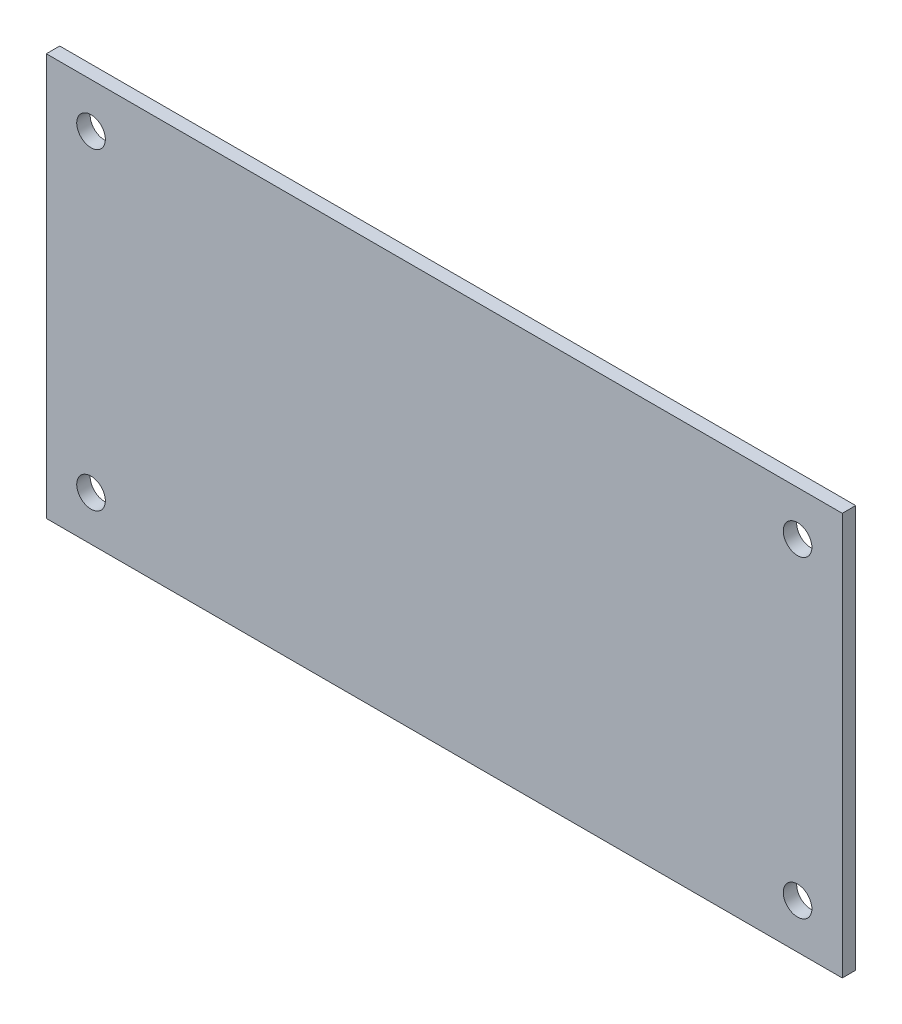
ISO-10303-21;
HEADER;
FILE_DESCRIPTION(('STEP AP214'),'2;1');
FILE_NAME('part.step','',(''),(''),'','','');
FILE_SCHEMA(('AUTOMOTIVE_DESIGN { 1 0 10303 214 1 1 1 1 }'));
ENDSEC;
DATA;
#1=APPLICATION_CONTEXT('core data for automotive mechanical design processes');
#2=APPLICATION_PROTOCOL_DEFINITION('international standard','automotive_design',2000,#1);
#3=PRODUCT_CONTEXT('',#1,'mechanical');
#4=PRODUCT('Part','Part','',(#3));
#5=PRODUCT_RELATED_PRODUCT_CATEGORY('part','',(#4));
#6=PRODUCT_DEFINITION_FORMATION('','',#4);
#7=PRODUCT_DEFINITION_CONTEXT('part definition',#1,'design');
#8=PRODUCT_DEFINITION('design','',#6,#7);
#9=PRODUCT_DEFINITION_SHAPE('','',#8);
#10=(LENGTH_UNIT() NAMED_UNIT(*) SI_UNIT(.MILLI.,.METRE.));
#11=(NAMED_UNIT(*) PLANE_ANGLE_UNIT() SI_UNIT($,.RADIAN.));
#12=(NAMED_UNIT(*) SI_UNIT($,.STERADIAN.) SOLID_ANGLE_UNIT());
#13=UNCERTAINTY_MEASURE_WITH_UNIT(LENGTH_MEASURE(1.E-05),#10,'distance_accuracy_value','');
#14=(GEOMETRIC_REPRESENTATION_CONTEXT(3) GLOBAL_UNCERTAINTY_ASSIGNED_CONTEXT((#13)) GLOBAL_UNIT_ASSIGNED_CONTEXT((#10,
#11,#12)) REPRESENTATION_CONTEXT('',''));
#15=CARTESIAN_POINT('',(0.,0.,0.));
#16=DIRECTION('',(0.,0.,1.));
#17=DIRECTION('',(1.,0.,0.));
#18=AXIS2_PLACEMENT_3D('',#15,#16,#17);
#19=CARTESIAN_POINT('',(0.,0.,1.5));
#20=DIRECTION('',(0.,0.,1.));
#21=DIRECTION('',(1.,0.,0.));
#22=AXIS2_PLACEMENT_3D('',#19,#20,#21);
#23=PLANE('',#22);
#24=CARTESIAN_POINT('',(39.5,-17.5,1.5));
#25=DIRECTION('',(0.,0.,1.));
#26=DIRECTION('',(1.,0.,0.));
#27=AXIS2_PLACEMENT_3D('',#24,#25,#26);
#28=CIRCLE('',#27,1.6);
#29=CARTESIAN_POINT('',(41.1,-17.5,1.5));
#30=VERTEX_POINT('',#29);
#31=EDGE_CURVE('E120',#30,#30,#28,.T.);
#32=ORIENTED_EDGE('',*,*,#31,.F.);
#33=EDGE_LOOP('',(#32));
#34=FACE_BOUND('',#33,.T.);
#35=CARTESIAN_POINT('',(-39.5,17.5,1.5));
#36=DIRECTION('',(0.,0.,1.));
#37=DIRECTION('',(1.,0.,0.));
#38=AXIS2_PLACEMENT_3D('',#35,#36,#37);
#39=CIRCLE('',#38,1.6);
#40=CARTESIAN_POINT('',(-37.9,17.5,1.5));
#41=VERTEX_POINT('',#40);
#42=EDGE_CURVE('E99',#41,#41,#39,.T.);
#43=ORIENTED_EDGE('',*,*,#42,.F.);
#44=EDGE_LOOP('',(#43));
#45=FACE_BOUND('',#44,.T.);
#46=DIRECTION('',(0.,-1.,0.));
#47=VECTOR('',#46,1.);
#48=CARTESIAN_POINT('',(-44.5,22.5,1.5));
#49=LINE('',#48,#47);
#50=CARTESIAN_POINT('',(-44.5,22.5,1.5));
#51=VERTEX_POINT('',#50);
#52=CARTESIAN_POINT('',(-44.5,-22.5,1.5));
#53=VERTEX_POINT('',#52);
#54=EDGE_CURVE('E84',#51,#53,#49,.T.);
#55=ORIENTED_EDGE('',*,*,#54,.T.);
#56=DIRECTION('',(1.,0.,0.));
#57=VECTOR('',#56,1.);
#58=CARTESIAN_POINT('',(-44.5,-22.5,1.5));
#59=LINE('',#58,#57);
#60=CARTESIAN_POINT('',(44.5,-22.5,1.5));
#61=VERTEX_POINT('',#60);
#62=EDGE_CURVE('E79',#53,#61,#59,.T.);
#63=ORIENTED_EDGE('',*,*,#62,.T.);
#64=DIRECTION('',(0.,1.,0.));
#65=VECTOR('',#64,1.);
#66=CARTESIAN_POINT('',(44.5,22.5,1.5));
#67=LINE('',#66,#65);
#68=CARTESIAN_POINT('',(44.5,22.5,1.5));
#69=VERTEX_POINT('',#68);
#70=EDGE_CURVE('E82',#61,#69,#67,.T.);
#71=ORIENTED_EDGE('',*,*,#70,.T.);
#72=DIRECTION('',(-1.,0.,0.));
#73=VECTOR('',#72,1.);
#74=CARTESIAN_POINT('',(-44.5,22.5,1.5));
#75=LINE('',#74,#73);
#76=EDGE_CURVE('E49',#69,#51,#75,.T.);
#77=ORIENTED_EDGE('',*,*,#76,.T.);
#78=EDGE_LOOP('',(#55,#63,#71,#77));
#79=FACE_BOUND('',#78,.T.);
#80=CARTESIAN_POINT('',(-39.5,-17.5,1.5));
#81=DIRECTION('',(0.,0.,1.));
#82=DIRECTION('',(1.,0.,0.));
#83=AXIS2_PLACEMENT_3D('',#80,#81,#82);
#84=CIRCLE('',#83,1.6);
#85=CARTESIAN_POINT('',(-37.9,-17.5,1.5));
#86=VERTEX_POINT('',#85);
#87=EDGE_CURVE('E114',#86,#86,#84,.T.);
#88=ORIENTED_EDGE('',*,*,#87,.F.);
#89=EDGE_LOOP('',(#88));
#90=FACE_BOUND('',#89,.T.);
#91=CARTESIAN_POINT('',(39.5,17.5,1.5));
#92=DIRECTION('',(0.,0.,1.));
#93=DIRECTION('',(1.,0.,0.));
#94=AXIS2_PLACEMENT_3D('',#91,#92,#93);
#95=CIRCLE('',#94,1.6);
#96=CARTESIAN_POINT('',(41.1,17.5,1.5));
#97=VERTEX_POINT('',#96);
#98=EDGE_CURVE('E126',#97,#97,#95,.T.);
#99=ORIENTED_EDGE('',*,*,#98,.F.);
#100=EDGE_LOOP('',(#99));
#101=FACE_BOUND('',#100,.T.);
#102=ADVANCED_FACE('F32',(#34,#45,#79,#90,#101),#23,.T.);
#103=CARTESIAN_POINT('',(0.,0.,0.));
#104=DIRECTION('',(0.,0.,1.));
#105=DIRECTION('',(1.,0.,0.));
#106=AXIS2_PLACEMENT_3D('',#103,#104,#105);
#107=PLANE('',#106);
#108=DIRECTION('',(0.,-1.,0.));
#109=VECTOR('',#108,1.);
#110=CARTESIAN_POINT('',(-44.5,22.5,0.));
#111=LINE('',#110,#109);
#112=CARTESIAN_POINT('',(-44.5,22.5,0.));
#113=VERTEX_POINT('',#112);
#114=CARTESIAN_POINT('',(-44.5,-22.5,0.));
#115=VERTEX_POINT('',#114);
#116=EDGE_CURVE('E96',#113,#115,#111,.T.);
#117=ORIENTED_EDGE('',*,*,#116,.F.);
#118=DIRECTION('',(-1.,0.,0.));
#119=VECTOR('',#118,1.);
#120=CARTESIAN_POINT('',(-44.5,22.5,0.));
#121=LINE('',#120,#119);
#122=CARTESIAN_POINT('',(44.5,22.5,0.));
#123=VERTEX_POINT('',#122);
#124=EDGE_CURVE('E72',#123,#113,#121,.T.);
#125=ORIENTED_EDGE('',*,*,#124,.F.);
#126=DIRECTION('',(0.,1.,0.));
#127=VECTOR('',#126,1.);
#128=CARTESIAN_POINT('',(44.5,22.5,0.));
#129=LINE('',#128,#127);
#130=CARTESIAN_POINT('',(44.5,-22.5,0.));
#131=VERTEX_POINT('',#130);
#132=EDGE_CURVE('E66',#131,#123,#129,.T.);
#133=ORIENTED_EDGE('',*,*,#132,.F.);
#134=DIRECTION('',(1.,0.,0.));
#135=VECTOR('',#134,1.);
#136=CARTESIAN_POINT('',(-44.5,-22.5,0.));
#137=LINE('',#136,#135);
#138=EDGE_CURVE('E88',#115,#131,#137,.T.);
#139=ORIENTED_EDGE('',*,*,#138,.F.);
#140=EDGE_LOOP('',(#117,#125,#133,#139));
#141=FACE_BOUND('',#140,.T.);
#142=CARTESIAN_POINT('',(-39.5,17.5,0.));
#143=DIRECTION('',(0.,0.,1.));
#144=DIRECTION('',(1.,0.,0.));
#145=AXIS2_PLACEMENT_3D('',#142,#143,#144);
#146=CIRCLE('',#145,1.6);
#147=CARTESIAN_POINT('',(-37.9,17.5,0.));
#148=VERTEX_POINT('',#147);
#149=EDGE_CURVE('E111',#148,#148,#146,.T.);
#150=ORIENTED_EDGE('',*,*,#149,.T.);
#151=EDGE_LOOP('',(#150));
#152=FACE_BOUND('',#151,.T.);
#153=CARTESIAN_POINT('',(-39.5,-17.5,0.));
#154=DIRECTION('',(0.,0.,1.));
#155=DIRECTION('',(1.,0.,0.));
#156=AXIS2_PLACEMENT_3D('',#153,#154,#155);
#157=CIRCLE('',#156,1.6);
#158=CARTESIAN_POINT('',(-37.9,-17.5,0.));
#159=VERTEX_POINT('',#158);
#160=EDGE_CURVE('E117',#159,#159,#157,.T.);
#161=ORIENTED_EDGE('',*,*,#160,.T.);
#162=EDGE_LOOP('',(#161));
#163=FACE_BOUND('',#162,.T.);
#164=CARTESIAN_POINT('',(39.5,-17.5,0.));
#165=DIRECTION('',(0.,0.,1.));
#166=DIRECTION('',(1.,0.,0.));
#167=AXIS2_PLACEMENT_3D('',#164,#165,#166);
#168=CIRCLE('',#167,1.6);
#169=CARTESIAN_POINT('',(41.1,-17.5,0.));
#170=VERTEX_POINT('',#169);
#171=EDGE_CURVE('E123',#170,#170,#168,.T.);
#172=ORIENTED_EDGE('',*,*,#171,.T.);
#173=EDGE_LOOP('',(#172));
#174=FACE_BOUND('',#173,.T.);
#175=CARTESIAN_POINT('',(39.5,17.5,0.));
#176=DIRECTION('',(0.,0.,1.));
#177=DIRECTION('',(1.,0.,0.));
#178=AXIS2_PLACEMENT_3D('',#175,#176,#177);
#179=CIRCLE('',#178,1.6);
#180=CARTESIAN_POINT('',(41.1,17.5,0.));
#181=VERTEX_POINT('',#180);
#182=EDGE_CURVE('E129',#181,#181,#179,.T.);
#183=ORIENTED_EDGE('',*,*,#182,.T.);
#184=EDGE_LOOP('',(#183));
#185=FACE_BOUND('',#184,.T.);
#186=ADVANCED_FACE('F107',(#141,#152,#163,#174,#185),#107,.F.);
#187=CARTESIAN_POINT('',(-44.5,22.5,1.5));
#188=DIRECTION('',(1.,0.,0.));
#189=DIRECTION('',(0.,0.,-1.));
#190=AXIS2_PLACEMENT_3D('',#187,#188,#189);
#191=PLANE('',#190);
#192=ORIENTED_EDGE('',*,*,#116,.T.);
#193=DIRECTION('',(0.,0.,-1.));
#194=VECTOR('',#193,1.);
#195=CARTESIAN_POINT('',(-44.5,-22.5,1.5));
#196=LINE('',#195,#194);
#197=EDGE_CURVE('E11',#53,#115,#196,.T.);
#198=ORIENTED_EDGE('',*,*,#197,.F.);
#199=ORIENTED_EDGE('',*,*,#54,.F.);
#200=DIRECTION('',(0.,0.,-1.));
#201=VECTOR('',#200,1.);
#202=CARTESIAN_POINT('',(-44.5,22.5,1.5));
#203=LINE('',#202,#201);
#204=EDGE_CURVE('E92',#51,#113,#203,.T.);
#205=ORIENTED_EDGE('',*,*,#204,.T.);
#206=EDGE_LOOP('',(#192,#198,#199,#205));
#207=FACE_BOUND('',#206,.T.);
#208=ADVANCED_FACE('F34',(#207),#191,.F.);
#209=CARTESIAN_POINT('',(-44.5,-22.5,1.5));
#210=DIRECTION('',(0.,1.,0.));
#211=DIRECTION('',(-1.,0.,0.));
#212=AXIS2_PLACEMENT_3D('',#209,#210,#211);
#213=PLANE('',#212);
#214=ORIENTED_EDGE('',*,*,#138,.T.);
#215=DIRECTION('',(0.,0.,-1.));
#216=VECTOR('',#215,1.);
#217=CARTESIAN_POINT('',(44.5,-22.5,1.5));
#218=LINE('',#217,#216);
#219=EDGE_CURVE('E41',#61,#131,#218,.T.);
#220=ORIENTED_EDGE('',*,*,#219,.F.);
#221=ORIENTED_EDGE('',*,*,#62,.F.);
#222=ORIENTED_EDGE('',*,*,#197,.T.);
#223=EDGE_LOOP('',(#214,#220,#221,#222));
#224=FACE_BOUND('',#223,.T.);
#225=ADVANCED_FACE('F87',(#224),#213,.F.);
#226=CARTESIAN_POINT('',(44.5,22.5,1.5));
#227=DIRECTION('',(-1.,0.,0.));
#228=DIRECTION('',(0.,0.,1.));
#229=AXIS2_PLACEMENT_3D('',#226,#227,#228);
#230=PLANE('',#229);
#231=ORIENTED_EDGE('',*,*,#132,.T.);
#232=DIRECTION('',(0.,0.,-1.));
#233=VECTOR('',#232,1.);
#234=CARTESIAN_POINT('',(44.5,22.5,1.5));
#235=LINE('',#234,#233);
#236=EDGE_CURVE('E89',#69,#123,#235,.T.);
#237=ORIENTED_EDGE('',*,*,#236,.F.);
#238=ORIENTED_EDGE('',*,*,#70,.F.);
#239=ORIENTED_EDGE('',*,*,#219,.T.);
#240=EDGE_LOOP('',(#231,#237,#238,#239));
#241=FACE_BOUND('',#240,.T.);
#242=ADVANCED_FACE('F90',(#241),#230,.F.);
#243=CARTESIAN_POINT('',(-44.5,22.5,1.5));
#244=DIRECTION('',(0.,-1.,0.));
#245=DIRECTION('',(0.,0.,-1.));
#246=AXIS2_PLACEMENT_3D('',#243,#244,#245);
#247=PLANE('',#246);
#248=ORIENTED_EDGE('',*,*,#124,.T.);
#249=ORIENTED_EDGE('',*,*,#204,.F.);
#250=ORIENTED_EDGE('',*,*,#76,.F.);
#251=ORIENTED_EDGE('',*,*,#236,.T.);
#252=EDGE_LOOP('',(#248,#249,#250,#251));
#253=FACE_BOUND('',#252,.T.);
#254=ADVANCED_FACE('F104',(#253),#247,.F.);
#255=CARTESIAN_POINT('',(-39.5,17.5,1.5));
#256=DIRECTION('',(0.,0.,-1.));
#257=DIRECTION('',(-1.,0.,0.));
#258=AXIS2_PLACEMENT_3D('',#255,#256,#257);
#259=CYLINDRICAL_SURFACE('',#258,1.6);
#260=ORIENTED_EDGE('',*,*,#42,.T.);
#261=EDGE_LOOP('',(#260));
#262=FACE_BOUND('',#261,.T.);
#263=ORIENTED_EDGE('',*,*,#149,.F.);
#264=EDGE_LOOP('',(#263));
#265=FACE_BOUND('',#264,.T.);
#266=ADVANCED_FACE('F148',(#262,#265),#259,.F.);
#267=CARTESIAN_POINT('',(-39.5,-17.5,1.5));
#268=DIRECTION('',(0.,0.,-1.));
#269=DIRECTION('',(-1.,0.,0.));
#270=AXIS2_PLACEMENT_3D('',#267,#268,#269);
#271=CYLINDRICAL_SURFACE('',#270,1.6);
#272=ORIENTED_EDGE('',*,*,#87,.T.);
#273=EDGE_LOOP('',(#272));
#274=FACE_BOUND('',#273,.T.);
#275=ORIENTED_EDGE('',*,*,#160,.F.);
#276=EDGE_LOOP('',(#275));
#277=FACE_BOUND('',#276,.T.);
#278=ADVANCED_FACE('F194',(#274,#277),#271,.F.);
#279=CARTESIAN_POINT('',(39.5,-17.5,1.5));
#280=DIRECTION('',(0.,0.,-1.));
#281=DIRECTION('',(-1.,0.,0.));
#282=AXIS2_PLACEMENT_3D('',#279,#280,#281);
#283=CYLINDRICAL_SURFACE('',#282,1.6);
#284=ORIENTED_EDGE('',*,*,#31,.T.);
#285=EDGE_LOOP('',(#284));
#286=FACE_BOUND('',#285,.T.);
#287=ORIENTED_EDGE('',*,*,#171,.F.);
#288=EDGE_LOOP('',(#287));
#289=FACE_BOUND('',#288,.T.);
#290=ADVANCED_FACE('F202',(#286,#289),#283,.F.);
#291=CARTESIAN_POINT('',(39.5,17.5,1.5));
#292=DIRECTION('',(0.,0.,-1.));
#293=DIRECTION('',(-1.,0.,0.));
#294=AXIS2_PLACEMENT_3D('',#291,#292,#293);
#295=CYLINDRICAL_SURFACE('',#294,1.6);
#296=ORIENTED_EDGE('',*,*,#98,.T.);
#297=EDGE_LOOP('',(#296));
#298=FACE_BOUND('',#297,.T.);
#299=ORIENTED_EDGE('',*,*,#182,.F.);
#300=EDGE_LOOP('',(#299));
#301=FACE_BOUND('',#300,.T.);
#302=ADVANCED_FACE('F135',(#298,#301),#295,.F.);
#303=CLOSED_SHELL('',(#102,#186,#208,#225,#242,#254,#266,#278,#290,#302));
#304=MANIFOLD_SOLID_BREP('B2',#303);
#305=ADVANCED_BREP_SHAPE_REPRESENTATION('',(#18,#304),#14);
#306=SHAPE_DEFINITION_REPRESENTATION(#9,#305);
ENDSEC;
END-ISO-10303-21;
